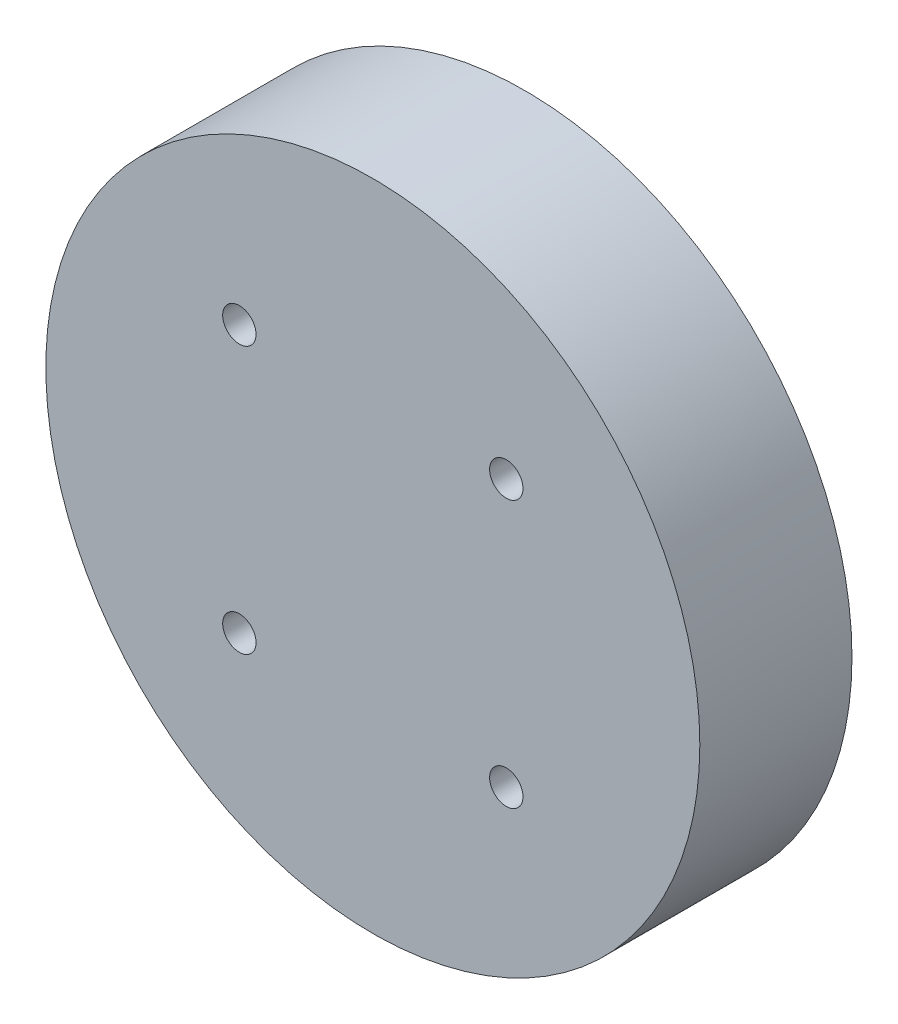
ISO-10303-21;
HEADER;
FILE_DESCRIPTION(('STEP AP214'),'2;1');
FILE_NAME('part.step','',(''),(''),'','','');
FILE_SCHEMA(('AUTOMOTIVE_DESIGN { 1 0 10303 214 1 1 1 1 }'));
ENDSEC;
DATA;
#1=APPLICATION_CONTEXT('core data for automotive mechanical design processes');
#2=APPLICATION_PROTOCOL_DEFINITION('international standard','automotive_design',2000,#1);
#3=PRODUCT_CONTEXT('',#1,'mechanical');
#4=PRODUCT('Part','Part','',(#3));
#5=PRODUCT_RELATED_PRODUCT_CATEGORY('part','',(#4));
#6=PRODUCT_DEFINITION_FORMATION('','',#4);
#7=PRODUCT_DEFINITION_CONTEXT('part definition',#1,'design');
#8=PRODUCT_DEFINITION('design','',#6,#7);
#9=PRODUCT_DEFINITION_SHAPE('','',#8);
#10=(LENGTH_UNIT() NAMED_UNIT(*) SI_UNIT(.MILLI.,.METRE.));
#11=(NAMED_UNIT(*) PLANE_ANGLE_UNIT() SI_UNIT($,.RADIAN.));
#12=(NAMED_UNIT(*) SI_UNIT($,.STERADIAN.) SOLID_ANGLE_UNIT());
#13=UNCERTAINTY_MEASURE_WITH_UNIT(LENGTH_MEASURE(1.E-05),#10,'distance_accuracy_value','');
#14=(GEOMETRIC_REPRESENTATION_CONTEXT(3) GLOBAL_UNCERTAINTY_ASSIGNED_CONTEXT((#13)) GLOBAL_UNIT_ASSIGNED_CONTEXT((#10,
#11,#12)) REPRESENTATION_CONTEXT('',''));
#15=CARTESIAN_POINT('',(0.,0.,0.));
#16=DIRECTION('',(0.,0.,1.));
#17=DIRECTION('',(1.,0.,0.));
#18=AXIS2_PLACEMENT_3D('',#15,#16,#17);
#19=CARTESIAN_POINT('',(0.,0.,11.4));
#20=DIRECTION('',(0.,0.,-1.));
#21=DIRECTION('',(-1.,0.,0.));
#22=AXIS2_PLACEMENT_3D('',#19,#20,#21);
#23=CYLINDRICAL_SURFACE('',#22,24.5);
#24=CARTESIAN_POINT('',(0.,0.,11.4));
#25=DIRECTION('',(0.,0.,1.));
#26=DIRECTION('',(1.,0.,0.));
#27=AXIS2_PLACEMENT_3D('',#24,#25,#26);
#28=CIRCLE('',#27,24.5);
#29=CARTESIAN_POINT('',(24.5,0.,11.4));
#30=VERTEX_POINT('',#29);
#31=EDGE_CURVE('E10',#30,#30,#28,.T.);
#32=ORIENTED_EDGE('',*,*,#31,.F.);
#33=EDGE_LOOP('',(#32));
#34=FACE_BOUND('',#33,.T.);
#35=CARTESIAN_POINT('',(0.,0.,0.));
#36=DIRECTION('',(0.,0.,1.));
#37=DIRECTION('',(1.,0.,0.));
#38=AXIS2_PLACEMENT_3D('',#35,#36,#37);
#39=CIRCLE('',#38,24.5);
#40=CARTESIAN_POINT('',(24.5,0.,0.));
#41=VERTEX_POINT('',#40);
#42=EDGE_CURVE('E42',#41,#41,#39,.T.);
#43=ORIENTED_EDGE('',*,*,#42,.T.);
#44=EDGE_LOOP('',(#43));
#45=FACE_BOUND('',#44,.T.);
#46=ADVANCED_FACE('F39',(#34,#45),#23,.T.);
#47=CARTESIAN_POINT('',(0.,0.,11.4));
#48=DIRECTION('',(0.,0.,1.));
#49=DIRECTION('',(1.,0.,0.));
#50=AXIS2_PLACEMENT_3D('',#47,#48,#49);
#51=PLANE('',#50);
#52=CARTESIAN_POINT('',(10.,10.,11.4));
#53=DIRECTION('',(0.,0.,1.));
#54=DIRECTION('',(1.,0.,0.));
#55=AXIS2_PLACEMENT_3D('',#52,#53,#54);
#56=CIRCLE('',#55,1.25);
#57=CARTESIAN_POINT('',(11.25,10.,11.4));
#58=VERTEX_POINT('',#57);
#59=EDGE_CURVE('E54',#58,#58,#56,.T.);
#60=ORIENTED_EDGE('',*,*,#59,.F.);
#61=EDGE_LOOP('',(#60));
#62=FACE_BOUND('',#61,.T.);
#63=CARTESIAN_POINT('',(-10.,-10.,11.4));
#64=DIRECTION('',(0.,0.,1.));
#65=DIRECTION('',(1.,0.,0.));
#66=AXIS2_PLACEMENT_3D('',#63,#64,#65);
#67=CIRCLE('',#66,1.25);
#68=CARTESIAN_POINT('',(-8.75,-10.,11.4));
#69=VERTEX_POINT('',#68);
#70=EDGE_CURVE('E60',#69,#69,#67,.T.);
#71=ORIENTED_EDGE('',*,*,#70,.F.);
#72=EDGE_LOOP('',(#71));
#73=FACE_BOUND('',#72,.T.);
#74=CARTESIAN_POINT('',(10.,-10.,11.4));
#75=DIRECTION('',(0.,0.,1.));
#76=DIRECTION('',(1.,0.,0.));
#77=AXIS2_PLACEMENT_3D('',#74,#75,#76);
#78=CIRCLE('',#77,1.25);
#79=CARTESIAN_POINT('',(11.25,-10.,11.4));
#80=VERTEX_POINT('',#79);
#81=EDGE_CURVE('E61',#80,#80,#78,.T.);
#82=ORIENTED_EDGE('',*,*,#81,.F.);
#83=EDGE_LOOP('',(#82));
#84=FACE_BOUND('',#83,.T.);
#85=CARTESIAN_POINT('',(-10.,10.,11.4));
#86=DIRECTION('',(0.,0.,1.));
#87=DIRECTION('',(1.,0.,0.));
#88=AXIS2_PLACEMENT_3D('',#85,#86,#87);
#89=CIRCLE('',#88,1.25);
#90=CARTESIAN_POINT('',(-8.75000000000001,10.,11.4));
#91=VERTEX_POINT('',#90);
#92=EDGE_CURVE('E51',#91,#91,#89,.T.);
#93=ORIENTED_EDGE('',*,*,#92,.F.);
#94=EDGE_LOOP('',(#93));
#95=FACE_BOUND('',#94,.T.);
#96=ORIENTED_EDGE('',*,*,#31,.T.);
#97=EDGE_LOOP('',(#96));
#98=FACE_BOUND('',#97,.T.);
#99=ADVANCED_FACE('F77',(#62,#73,#84,#95,#98),#51,.T.);
#100=CARTESIAN_POINT('',(0.,0.,0.));
#101=DIRECTION('',(0.,0.,1.));
#102=DIRECTION('',(1.,0.,0.));
#103=AXIS2_PLACEMENT_3D('',#100,#101,#102);
#104=PLANE('',#103);
#105=ORIENTED_EDGE('',*,*,#42,.F.);
#106=EDGE_LOOP('',(#105));
#107=FACE_BOUND('',#106,.T.);
#108=ADVANCED_FACE('F80',(#107),#104,.F.);
#109=CARTESIAN_POINT('',(-10.,10.,3.4));
#110=DIRECTION('',(0.,0.,1.));
#111=DIRECTION('',(1.,0.,0.));
#112=AXIS2_PLACEMENT_3D('',#109,#110,#111);
#113=CYLINDRICAL_SURFACE('',#112,1.25);
#114=CARTESIAN_POINT('',(-10.,10.,3.4));
#115=DIRECTION('',(0.,0.,1.));
#116=DIRECTION('',(1.,0.,0.));
#117=AXIS2_PLACEMENT_3D('',#114,#115,#116);
#118=CIRCLE('',#117,1.25);
#119=CARTESIAN_POINT('',(-8.75000000000001,10.,3.4));
#120=VERTEX_POINT('',#119);
#121=EDGE_CURVE('E49',#120,#120,#118,.T.);
#122=ORIENTED_EDGE('',*,*,#121,.F.);
#123=EDGE_LOOP('',(#122));
#124=FACE_BOUND('',#123,.T.);
#125=ORIENTED_EDGE('',*,*,#92,.T.);
#126=EDGE_LOOP('',(#125));
#127=FACE_BOUND('',#126,.T.);
#128=ADVANCED_FACE('F85',(#124,#127),#113,.F.);
#129=CARTESIAN_POINT('',(-10.,10.,3.4));
#130=DIRECTION('',(0.,0.,1.));
#131=DIRECTION('',(1.,0.,0.));
#132=AXIS2_PLACEMENT_3D('',#129,#130,#131);
#133=PLANE('',#132);
#134=ORIENTED_EDGE('',*,*,#121,.T.);
#135=EDGE_LOOP('',(#134));
#136=FACE_BOUND('',#135,.T.);
#137=ADVANCED_FACE('F87',(#136),#133,.T.);
#138=CARTESIAN_POINT('',(10.,-10.,3.4));
#139=DIRECTION('',(0.,0.,1.));
#140=DIRECTION('',(1.,0.,0.));
#141=AXIS2_PLACEMENT_3D('',#138,#139,#140);
#142=CYLINDRICAL_SURFACE('',#141,1.25);
#143=CARTESIAN_POINT('',(10.,-10.,3.4));
#144=DIRECTION('',(0.,0.,1.));
#145=DIRECTION('',(1.,0.,0.));
#146=AXIS2_PLACEMENT_3D('',#143,#144,#145);
#147=CIRCLE('',#146,1.25);
#148=CARTESIAN_POINT('',(11.25,-10.,3.4));
#149=VERTEX_POINT('',#148);
#150=EDGE_CURVE('E69',#149,#149,#147,.T.);
#151=ORIENTED_EDGE('',*,*,#150,.F.);
#152=EDGE_LOOP('',(#151));
#153=FACE_BOUND('',#152,.T.);
#154=ORIENTED_EDGE('',*,*,#81,.T.);
#155=EDGE_LOOP('',(#154));
#156=FACE_BOUND('',#155,.T.);
#157=ADVANCED_FACE('F75',(#153,#156),#142,.F.);
#158=CARTESIAN_POINT('',(10.,-10.,3.4));
#159=DIRECTION('',(0.,0.,1.));
#160=DIRECTION('',(1.,0.,0.));
#161=AXIS2_PLACEMENT_3D('',#158,#159,#160);
#162=PLANE('',#161);
#163=ORIENTED_EDGE('',*,*,#150,.T.);
#164=EDGE_LOOP('',(#163));
#165=FACE_BOUND('',#164,.T.);
#166=ADVANCED_FACE('F141',(#165),#162,.T.);
#167=CARTESIAN_POINT('',(-10.,-10.,3.4));
#168=DIRECTION('',(0.,0.,1.));
#169=DIRECTION('',(1.,0.,0.));
#170=AXIS2_PLACEMENT_3D('',#167,#168,#169);
#171=CYLINDRICAL_SURFACE('',#170,1.25);
#172=CARTESIAN_POINT('',(-10.,-10.,3.4));
#173=DIRECTION('',(0.,0.,1.));
#174=DIRECTION('',(1.,0.,0.));
#175=AXIS2_PLACEMENT_3D('',#172,#173,#174);
#176=CIRCLE('',#175,1.25);
#177=CARTESIAN_POINT('',(-8.75,-10.,3.4));
#178=VERTEX_POINT('',#177);
#179=EDGE_CURVE('E57',#178,#178,#176,.T.);
#180=ORIENTED_EDGE('',*,*,#179,.F.);
#181=EDGE_LOOP('',(#180));
#182=FACE_BOUND('',#181,.T.);
#183=ORIENTED_EDGE('',*,*,#70,.T.);
#184=EDGE_LOOP('',(#183));
#185=FACE_BOUND('',#184,.T.);
#186=ADVANCED_FACE('F152',(#182,#185),#171,.F.);
#187=CARTESIAN_POINT('',(-10.,-10.,3.4));
#188=DIRECTION('',(0.,0.,1.));
#189=DIRECTION('',(1.,0.,0.));
#190=AXIS2_PLACEMENT_3D('',#187,#188,#189);
#191=PLANE('',#190);
#192=ORIENTED_EDGE('',*,*,#179,.T.);
#193=EDGE_LOOP('',(#192));
#194=FACE_BOUND('',#193,.T.);
#195=ADVANCED_FACE('F163',(#194),#191,.T.);
#196=CARTESIAN_POINT('',(10.,10.,3.4));
#197=DIRECTION('',(0.,0.,1.));
#198=DIRECTION('',(1.,0.,0.));
#199=AXIS2_PLACEMENT_3D('',#196,#197,#198);
#200=CYLINDRICAL_SURFACE('',#199,1.25);
#201=CARTESIAN_POINT('',(10.,10.,3.4));
#202=DIRECTION('',(0.,0.,1.));
#203=DIRECTION('',(1.,0.,0.));
#204=AXIS2_PLACEMENT_3D('',#201,#202,#203);
#205=CIRCLE('',#204,1.25);
#206=CARTESIAN_POINT('',(11.25,10.,3.4));
#207=VERTEX_POINT('',#206);
#208=EDGE_CURVE('E64',#207,#207,#205,.T.);
#209=ORIENTED_EDGE('',*,*,#208,.F.);
#210=EDGE_LOOP('',(#209));
#211=FACE_BOUND('',#210,.T.);
#212=ORIENTED_EDGE('',*,*,#59,.T.);
#213=EDGE_LOOP('',(#212));
#214=FACE_BOUND('',#213,.T.);
#215=ADVANCED_FACE('F174',(#211,#214),#200,.F.);
#216=CARTESIAN_POINT('',(10.,10.,3.4));
#217=DIRECTION('',(0.,0.,1.));
#218=DIRECTION('',(1.,0.,0.));
#219=AXIS2_PLACEMENT_3D('',#216,#217,#218);
#220=PLANE('',#219);
#221=ORIENTED_EDGE('',*,*,#208,.T.);
#222=EDGE_LOOP('',(#221));
#223=FACE_BOUND('',#222,.T.);
#224=ADVANCED_FACE('F185',(#223),#220,.T.);
#225=CLOSED_SHELL('',(#46,#99,#108,#128,#137,#157,#166,#186,#195,#215,#224));
#226=MANIFOLD_SOLID_BREP('B2',#225);
#227=ADVANCED_BREP_SHAPE_REPRESENTATION('',(#18,#226),#14);
#228=SHAPE_DEFINITION_REPRESENTATION(#9,#227);
ENDSEC;
END-ISO-10303-21;
